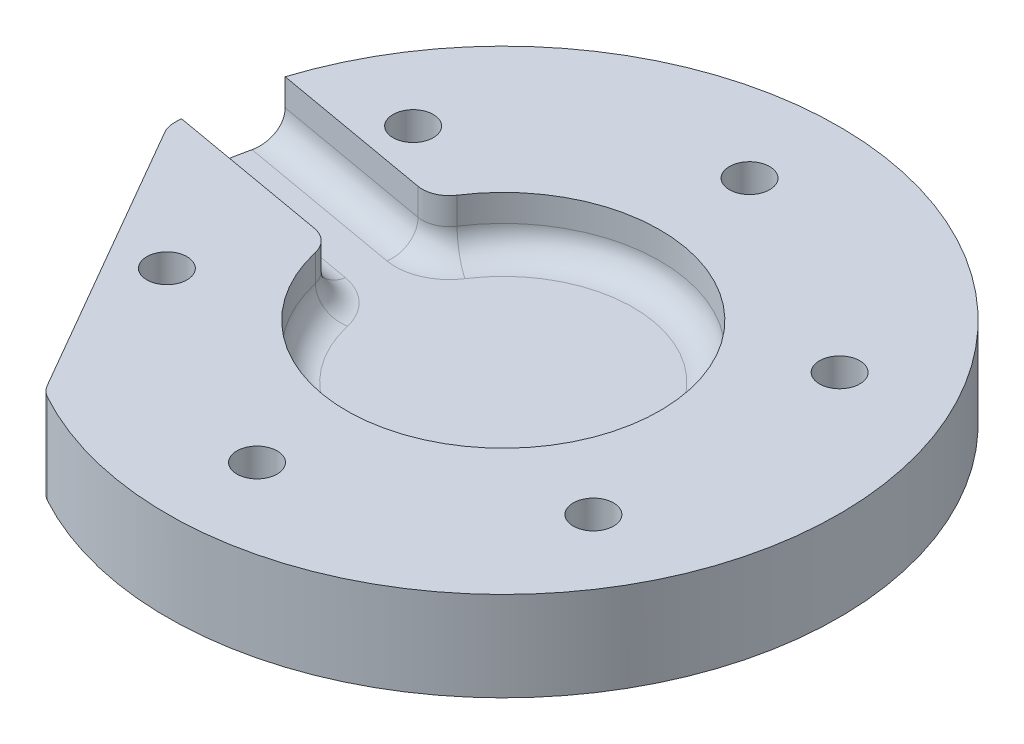
ISO-10303-21;
HEADER;
FILE_DESCRIPTION(('STEP AP214'),'2;1');
FILE_NAME('part.step','',(''),(''),'','','');
FILE_SCHEMA(('AUTOMOTIVE_DESIGN { 1 0 10303 214 1 1 1 1 }'));
ENDSEC;
DATA;
#1=APPLICATION_CONTEXT('core data for automotive mechanical design processes');
#2=APPLICATION_PROTOCOL_DEFINITION('international standard','automotive_design',2000,#1);
#3=PRODUCT_CONTEXT('',#1,'mechanical');
#4=PRODUCT('Part','Part','',(#3));
#5=PRODUCT_RELATED_PRODUCT_CATEGORY('part','',(#4));
#6=PRODUCT_DEFINITION_FORMATION('','',#4);
#7=PRODUCT_DEFINITION_CONTEXT('part definition',#1,'design');
#8=PRODUCT_DEFINITION('design','',#6,#7);
#9=PRODUCT_DEFINITION_SHAPE('','',#8);
#10=(LENGTH_UNIT() NAMED_UNIT(*) SI_UNIT(.MILLI.,.METRE.));
#11=(NAMED_UNIT(*) PLANE_ANGLE_UNIT() SI_UNIT($,.RADIAN.));
#12=(NAMED_UNIT(*) SI_UNIT($,.STERADIAN.) SOLID_ANGLE_UNIT());
#13=UNCERTAINTY_MEASURE_WITH_UNIT(LENGTH_MEASURE(1.E-05),#10,'distance_accuracy_value','');
#14=(GEOMETRIC_REPRESENTATION_CONTEXT(3) GLOBAL_UNCERTAINTY_ASSIGNED_CONTEXT((#13)) GLOBAL_UNIT_ASSIGNED_CONTEXT((#10,
#11,#12)) REPRESENTATION_CONTEXT('',''));
#15=CARTESIAN_POINT('',(0.,0.,0.));
#16=DIRECTION('',(0.,0.,1.));
#17=DIRECTION('',(1.,0.,0.));
#18=AXIS2_PLACEMENT_3D('',#15,#16,#17);
#19=CARTESIAN_POINT('',(0.,10.,0.));
#20=DIRECTION('',(0.,1.,0.));
#21=DIRECTION('',(0.,0.,1.));
#22=AXIS2_PLACEMENT_3D('',#19,#20,#21);
#23=PLANE('',#22);
#24=CARTESIAN_POINT('',(-23.8156986040703,10.,13.750000000001));
#25=DIRECTION('',(0.,1.,0.));
#26=DIRECTION('',(0.,0.,1.));
#27=AXIS2_PLACEMENT_3D('',#24,#25,#26);
#28=CIRCLE('',#27,2.25);
#29=CARTESIAN_POINT('',(-23.8156986040703,10.,16.000000000001));
#30=VERTEX_POINT('',#29);
#31=EDGE_CURVE('E174',#30,#30,#28,.T.);
#32=ORIENTED_EDGE('',*,*,#31,.F.);
#33=EDGE_LOOP('',(#32));
#34=FACE_BOUND('',#33,.T.);
#35=CARTESIAN_POINT('',(23.8156986040738,10.,13.749999999999));
#36=DIRECTION('',(0.,1.,0.));
#37=DIRECTION('',(0.,0.,1.));
#38=AXIS2_PLACEMENT_3D('',#35,#36,#37);
#39=CIRCLE('',#38,2.25);
#40=CARTESIAN_POINT('',(23.8156986040738,10.,15.999999999999));
#41=VERTEX_POINT('',#40);
#42=EDGE_CURVE('E186',#41,#41,#39,.T.);
#43=ORIENTED_EDGE('',*,*,#42,.F.);
#44=EDGE_LOOP('',(#43));
#45=FACE_BOUND('',#44,.T.);
#46=CARTESIAN_POINT('',(0.,10.,-27.5));
#47=DIRECTION('',(0.,1.,0.));
#48=DIRECTION('',(0.,0.,1.));
#49=AXIS2_PLACEMENT_3D('',#46,#47,#48);
#50=CIRCLE('',#49,2.25);
#51=CARTESIAN_POINT('',(0.,10.,-25.25));
#52=VERTEX_POINT('',#51);
#53=EDGE_CURVE('E198',#52,#52,#50,.T.);
#54=ORIENTED_EDGE('',*,*,#53,.F.);
#55=EDGE_LOOP('',(#54));
#56=FACE_BOUND('',#55,.T.);
#57=CARTESIAN_POINT('',(23.8156986040726,10.,-13.750000000001));
#58=DIRECTION('',(0.,1.,0.));
#59=DIRECTION('',(0.,0.,1.));
#60=AXIS2_PLACEMENT_3D('',#57,#58,#59);
#61=CIRCLE('',#60,2.25);
#62=CARTESIAN_POINT('',(23.8156986040726,10.,-11.500000000001));
#63=VERTEX_POINT('',#62);
#64=EDGE_CURVE('E192',#63,#63,#61,.T.);
#65=ORIENTED_EDGE('',*,*,#64,.F.);
#66=EDGE_LOOP('',(#65));
#67=FACE_BOUND('',#66,.T.);
#68=CARTESIAN_POINT('',(2.33805547061302E-12,10.,27.5));
#69=DIRECTION('',(0.,1.,0.));
#70=DIRECTION('',(0.,0.,1.));
#71=AXIS2_PLACEMENT_3D('',#68,#69,#70);
#72=CIRCLE('',#71,2.25);
#73=CARTESIAN_POINT('',(2.33805547061302E-12,10.,29.75));
#74=VERTEX_POINT('',#73);
#75=EDGE_CURVE('E180',#74,#74,#72,.T.);
#76=ORIENTED_EDGE('',*,*,#75,.F.);
#77=EDGE_LOOP('',(#76));
#78=FACE_BOUND('',#77,.T.);
#79=CARTESIAN_POINT('',(-23.8156986040715,10.,-13.749999999999));
#80=DIRECTION('',(0.,1.,0.));
#81=DIRECTION('',(0.,0.,1.));
#82=AXIS2_PLACEMENT_3D('',#79,#80,#81);
#83=CIRCLE('',#82,2.25);
#84=CARTESIAN_POINT('',(-23.8156986040715,10.,-11.499999999999));
#85=VERTEX_POINT('',#84);
#86=EDGE_CURVE('E168',#85,#85,#83,.T.);
#87=ORIENTED_EDGE('',*,*,#86,.F.);
#88=EDGE_LOOP('',(#87));
#89=FACE_BOUND('',#88,.T.);
#90=DIRECTION('',(-0.5,0.,-0.866025403784439));
#91=VECTOR('',#90,1.);
#92=CARTESIAN_POINT('',(-28.1249999999994,10.,16.2379763209579));
#93=LINE('',#92,#91);
#94=CARTESIAN_POINT('',(-19.1609298327772,10.,31.7642012931993));
#95=VERTEX_POINT('',#94);
#96=CARTESIAN_POINT('',(-37.0890701672217,10.,0.711751348716493));
#97=VERTEX_POINT('',#96);
#98=EDGE_CURVE('E139',#95,#97,#93,.T.);
#99=ORIENTED_EDGE('',*,*,#98,.F.);
#100=CARTESIAN_POINT('',(-16.5628536214239,10.,30.2642012931993));
#101=DIRECTION('',(0.,1.,0.));
#102=DIRECTION('',(0.,0.,1.));
#103=AXIS2_PLACEMENT_3D('',#100,#101,#102);
#104=CIRCLE('',#103,3.);
#105=CARTESIAN_POINT('',(-18.0031017624172,10.,32.8958709708688));
#106=VERTEX_POINT('',#105);
#107=EDGE_CURVE('E145',#95,#106,#104,.T.);
#108=ORIENTED_EDGE('',*,*,#107,.T.);
#109=CARTESIAN_POINT('',(0.,10.,0.));
#110=DIRECTION('',(0.,1.,0.));
#111=DIRECTION('',(0.,0.,1.));
#112=AXIS2_PLACEMENT_3D('',#109,#110,#111);
#113=CIRCLE('',#112,37.5);
#114=CARTESIAN_POINT('',(-35.7323085095947,10.,-11.3777031326691));
#115=VERTEX_POINT('',#114);
#116=EDGE_CURVE('E142',#106,#115,#113,.T.);
#117=ORIENTED_EDGE('',*,*,#116,.T.);
#118=DIRECTION('',(-0.984807753012208,0.,-0.173648177666934));
#119=VECTOR('',#118,1.);
#120=CARTESIAN_POINT('',(0.868240888334671,10.,-4.92403876506104));
#121=LINE('',#120,#119);
#122=CARTESIAN_POINT('',(-17.7195978261983,10.,-8.20157624349062));
#123=VERTEX_POINT('',#122);
#124=EDGE_CURVE('E128',#123,#115,#121,.T.);
#125=ORIENTED_EDGE('',*,*,#124,.F.);
#126=CARTESIAN_POINT('',(-17.1986532931975,10.,-11.1559995025272));
#127=DIRECTION('',(0.,1.,0.));
#128=DIRECTION('',(0.,0.,1.));
#129=AXIS2_PLACEMENT_3D('',#126,#127,#128);
#130=CIRCLE('',#129,3.);
#131=CARTESIAN_POINT('',(-14.68177720151,10.,-9.52341420947448));
#132=VERTEX_POINT('',#131);
#133=EDGE_CURVE('E219',#123,#132,#130,.T.);
#134=ORIENTED_EDGE('',*,*,#133,.T.);
#135=CARTESIAN_POINT('',(0.,10.,0.));
#136=DIRECTION('',(0.,1.,0.));
#137=DIRECTION('',(0.,0.,1.));
#138=AXIS2_PLACEMENT_3D('',#135,#136,#137);
#139=CIRCLE('',#138,17.5);
#140=CARTESIAN_POINT('',(-17.053557189156,10.,3.9276185145947));
#141=VERTEX_POINT('',#140);
#142=EDGE_CURVE('E159',#141,#132,#139,.T.);
#143=ORIENTED_EDGE('',*,*,#142,.F.);
#144=CARTESIAN_POINT('',(-19.9770241358684,10.,4.60092454566808));
#145=DIRECTION('',(0.,1.,0.));
#146=DIRECTION('',(0.,0.,1.));
#147=AXIS2_PLACEMENT_3D('',#144,#145,#146);
#148=CIRCLE('',#147,3.);
#149=CARTESIAN_POINT('',(-19.4560796028676,10.,1.64650128663146));
#150=VERTEX_POINT('',#149);
#151=EDGE_CURVE('E221',#141,#150,#148,.T.);
#152=ORIENTED_EDGE('',*,*,#151,.T.);
#153=DIRECTION('',(-0.984807753012208,0.,-0.173648177666934));
#154=VECTOR('',#153,1.);
#155=CARTESIAN_POINT('',(-0.868240888334671,10.,4.92403876506104));
#156=LINE('',#155,#154);
#157=CARTESIAN_POINT('',(-37.468790286264,10.,-1.52962560254701));
#158=VERTEX_POINT('',#157);
#159=EDGE_CURVE('E138',#150,#158,#156,.T.);
#160=ORIENTED_EDGE('',*,*,#159,.T.);
#161=CARTESIAN_POINT('',(-37.4902108215961,10.,-0.856792012264681));
#162=VERTEX_POINT('',#161);
#163=EDGE_CURVE('E149',#158,#162,#113,.T.);
#164=ORIENTED_EDGE('',*,*,#163,.T.);
#165=CARTESIAN_POINT('',(-34.4909939558684,10.,-0.788248651283506));
#166=DIRECTION('',(0.,1.,0.));
#167=DIRECTION('',(0.,0.,1.));
#168=AXIS2_PLACEMENT_3D('',#165,#166,#167);
#169=CIRCLE('',#168,3.);
#170=EDGE_CURVE('E223',#162,#97,#169,.T.);
#171=ORIENTED_EDGE('',*,*,#170,.T.);
#172=EDGE_LOOP('',(#99,#108,#117,#125,#134,#143,#152,#160,#164,#171));
#173=FACE_BOUND('',#172,.T.);
#174=ADVANCED_FACE('F33',(#34,#45,#56,#67,#78,#89,#173),#23,.T.);
#175=CARTESIAN_POINT('',(0.,10.,0.));
#176=DIRECTION('',(0.,-1.,0.));
#177=DIRECTION('',(0.,0.,-1.));
#178=AXIS2_PLACEMENT_3D('',#175,#176,#177);
#179=CYLINDRICAL_SURFACE('',#178,37.5);
#180=ORIENTED_EDGE('',*,*,#116,.F.);
#181=DIRECTION('',(0.,-1.,0.));
#182=VECTOR('',#181,1.);
#183=CARTESIAN_POINT('',(-18.0031017624172,10.,32.8958709708688));
#184=LINE('',#183,#182);
#185=CARTESIAN_POINT('',(-18.0031017624172,0.,32.8958709708688));
#186=VERTEX_POINT('',#185);
#187=EDGE_CURVE('E208',#106,#186,#184,.T.);
#188=ORIENTED_EDGE('',*,*,#187,.T.);
#189=CARTESIAN_POINT('',(0.,0.,0.));
#190=DIRECTION('',(0.,1.,0.));
#191=DIRECTION('',(0.,0.,1.));
#192=AXIS2_PLACEMENT_3D('',#189,#190,#191);
#193=CIRCLE('',#192,37.5);
#194=CARTESIAN_POINT('',(-37.4902108215961,0.,-0.856792012264681));
#195=VERTEX_POINT('',#194);
#196=EDGE_CURVE('E150',#186,#195,#193,.T.);
#197=ORIENTED_EDGE('',*,*,#196,.T.);
#198=DIRECTION('',(0.,-1.,0.));
#199=VECTOR('',#198,1.);
#200=CARTESIAN_POINT('',(-37.4902108215961,10.,-0.856792012264681));
#201=LINE('',#200,#199);
#202=EDGE_CURVE('E204',#195,#162,#201,.F.);
#203=ORIENTED_EDGE('',*,*,#202,.T.);
#204=ORIENTED_EDGE('',*,*,#163,.F.);
#205=DIRECTION('',(0.,1.,0.));
#206=VECTOR('',#205,1.);
#207=CARTESIAN_POINT('',(-37.468790286264,4.,-1.52962560254701));
#208=LINE('',#207,#206);
#209=CARTESIAN_POINT('',(-37.468790286264,7.,-1.52962560254701));
#210=VERTEX_POINT('',#209);
#211=EDGE_CURVE('E155',#210,#158,#208,.T.);
#212=ORIENTED_EDGE('',*,*,#211,.F.);
#213=CARTESIAN_POINT('',(-37.468790286264,7.,-1.52962560254701));
#214=CARTESIAN_POINT('',(-37.4687885385674,6.91607473093555,-1.52961665398384));
#215=CARTESIAN_POINT('',(-37.4686452889399,6.83215369455785,-1.53317602931308));
#216=CARTESIAN_POINT('',(-37.468063227685,6.66491826832527,-1.54736234990552));
#217=CARTESIAN_POINT('',(-37.4676244382832,6.58160383332813,-1.55798876370281));
#218=CARTESIAN_POINT('',(-37.4664393852418,6.41625662107854,-1.5862247968106));
#219=CARTESIAN_POINT('',(-37.4656934552811,6.33422255290289,-1.60382683698727));
#220=CARTESIAN_POINT('',(-37.4638703778373,6.17195103866243,-1.64585988350524));
#221=CARTESIAN_POINT('',(-37.4627932325401,6.09171358074312,-1.67029084477316));
#222=CARTESIAN_POINT('',(-37.4590179293151,5.85448826748709,-1.75360078025125));
#223=CARTESIAN_POINT('',(-37.4557753329092,5.70089770069336,-1.82251224893352));
#224=CARTESIAN_POINT('',(-37.4475192496891,5.40749281606239,-1.98490953996724));
#225=CARTESIAN_POINT('',(-37.4425058795835,5.26767759109256,-2.07839374266814));
#226=CARTESIAN_POINT('',(-37.4302981101241,5.00487012995653,-2.2877513212175));
#227=CARTESIAN_POINT('',(-37.4230927793752,4.88196680121549,-2.40373583178031));
#228=CARTESIAN_POINT('',(-37.406144534804,4.6572171945591,-2.654449907205));
#229=CARTESIAN_POINT('',(-37.3964010702185,4.55537549553449,-2.78918353757931));
#230=CARTESIAN_POINT('',(-37.3740313302424,4.3749911604644,-3.07447055090138));
#231=CARTESIAN_POINT('',(-37.3613863986207,4.29660721864267,-3.22512275102231));
#232=CARTESIAN_POINT('',(-37.3331343057481,4.16631519135388,-3.53716805156448));
#233=CARTESIAN_POINT('',(-37.3175289133604,4.11439136402112,-3.69855470099355));
#234=CARTESIAN_POINT('',(-37.2891191848984,4.05106027067528,-3.97288763283056));
#235=CARTESIAN_POINT('',(-37.2770964616604,4.03193164985782,-4.08419359322241));
#236=CARTESIAN_POINT('',(-37.2519008419326,4.0064015837983,-4.30797898586863));
#237=CARTESIAN_POINT('',(-37.2387294483442,3.9999837612315,-4.42045672014535));
#238=CARTESIAN_POINT('',(-37.2250266101708,4.,-4.53292332519234));
#239=B_SPLINE_CURVE_WITH_KNOTS('',3,(#213,#214,#215,#216,#217,#218,#219,#220,#221,#222,#223,
#224,#225,#226,#227,#228,#229,#230,#231,#232,#233,#234,#235,#236,#237,#238),.UNSPECIFIED.,.F.,
.F.,(4,2,2,2,2,2,2,2,2,2,2,2,4),(0.,0.251692700658805,0.503366475289664,0.754767548613932,
1.00616696263818,1.50869595507598,2.01119183286945,2.51623594149171,3.02138973376223,
3.52988746532684,4.03808232308492,4.378130837416,4.71774092787654),.UNSPECIFIED.);
#240=CARTESIAN_POINT('',(-37.2250266101708,4.,-4.53292332519234));
#241=VERTEX_POINT('',#240);
#242=EDGE_CURVE('E11',#210,#241,#239,.T.);
#243=ORIENTED_EDGE('',*,*,#242,.T.);
#244=CARTESIAN_POINT('',(0.,4.,0.));
#245=DIRECTION('',(0.,1.,0.));
#246=DIRECTION('',(0.,0.,1.));
#247=AXIS2_PLACEMENT_3D('',#244,#245,#246);
#248=CIRCLE('',#247,37.5);
#249=CARTESIAN_POINT('',(-36.5304338995031,4.,-8.47215433724118));
#250=VERTEX_POINT('',#249);
#251=EDGE_CURVE('E156',#250,#241,#248,.T.);
#252=ORIENTED_EDGE('',*,*,#251,.F.);
#253=CARTESIAN_POINT('',(-36.5304338995031,4.,-8.47215433724118));
#254=CARTESIAN_POINT('',(-36.5113061766243,3.99999185556205,-8.55464202668558));
#255=CARTESIAN_POINT('',(-36.4918947558201,4.00357480316312,-8.63705911337248));
#256=CARTESIAN_POINT('',(-36.4526606320191,4.01785162064364,-8.80117013385181));
#257=CARTESIAN_POINT('',(-36.4328379598345,4.0285449596416,-8.88286412117144));
#258=CARTESIAN_POINT('',(-36.3929526662557,4.0569584087229,-9.04488587081703));
#259=CARTESIAN_POINT('',(-36.3728902791517,4.07467212781287,-9.12521480664457));
#260=CARTESIAN_POINT('',(-36.3326869522386,4.11697580130757,-9.28399591653277));
#261=CARTESIAN_POINT('',(-36.3125460128146,4.14156572205405,-9.36244809977789));
#262=CARTESIAN_POINT('',(-36.25225729475,4.22543430714798,-9.59422817162467));
#263=CARTESIAN_POINT('',(-36.212222077861,4.29482717691522,-9.74406672595418));
#264=CARTESIAN_POINT('',(-36.1341008059691,4.45850047242244,-10.0298950754094));
#265=CARTESIAN_POINT('',(-36.096014557923,4.55277842760379,-10.1658862434292));
#266=CARTESIAN_POINT('',(-36.0232459930632,4.76392513867184,-10.4208147497941));
#267=CARTESIAN_POINT('',(-35.9885738523071,4.88085851983349,-10.5397015653744));
#268=CARTESIAN_POINT('',(-35.9243208215486,5.1338991363961,-10.7566732352616));
#269=CARTESIAN_POINT('',(-35.8947408385076,5.27000977961426,-10.8547543846039));
#270=CARTESIAN_POINT('',(-35.8421275555655,5.5573559432218,-11.0272407929011));
#271=CARTESIAN_POINT('',(-35.8190852992912,5.70857038413879,-11.1016784591763));
#272=CARTESIAN_POINT('',(-35.7806578658865,6.02197020400217,-11.2249150704758));
#273=CARTESIAN_POINT('',(-35.7652674953278,6.18414805679171,-11.2737314062651));
#274=CARTESIAN_POINT('',(-35.746880684548,6.45615411997131,-11.3318616950539));
#275=CARTESIAN_POINT('',(-35.7414258024141,6.56420517061319,-11.3490408699051));
#276=CARTESIAN_POINT('',(-35.7341371978182,6.78148800360131,-11.3719602980172));
#277=CARTESIAN_POINT('',(-35.7322986576543,6.89071801987915,-11.3777157700632));
#278=CARTESIAN_POINT('',(-35.7323085095947,7.,-11.3777031326691));
#279=B_SPLINE_CURVE_WITH_KNOTS('',3,(#253,#254,#255,#256,#257,#258,#259,#260,#261,#262,#263,
#264,#265,#266,#267,#268,#269,#270,#271,#272,#273,#274,#275,#276,#277,#278),.UNSPECIFIED.,.F.,
.F.,(4,2,2,2,2,2,2,2,2,2,2,2,4),(0.,0.253944686852565,0.50787041562048,0.761565512474324,
1.01525936754024,1.52237729016386,2.0294448857095,2.5379807881834,3.04660717219958,
3.55453336036125,4.06211434061416,4.39012991539726,4.71770821006358),.UNSPECIFIED.);
#280=CARTESIAN_POINT('',(-35.7323085095947,7.,-11.3777031326691));
#281=VERTEX_POINT('',#280);
#282=EDGE_CURVE('E43',#250,#281,#279,.T.);
#283=ORIENTED_EDGE('',*,*,#282,.T.);
#284=DIRECTION('',(0.,1.,0.));
#285=VECTOR('',#284,1.);
#286=CARTESIAN_POINT('',(-35.7323085095947,4.,-11.3777031326691));
#287=LINE('',#286,#285);
#288=EDGE_CURVE('E132',#281,#115,#287,.T.);
#289=ORIENTED_EDGE('',*,*,#288,.T.);
#290=EDGE_LOOP('',(#180,#188,#197,#203,#204,#212,#243,#252,#283,#289));
#291=FACE_BOUND('',#290,.T.);
#292=ADVANCED_FACE('F152',(#291),#179,.T.);
#293=CARTESIAN_POINT('',(0.,0.,0.));
#294=DIRECTION('',(0.,1.,0.));
#295=DIRECTION('',(0.,0.,1.));
#296=AXIS2_PLACEMENT_3D('',#293,#294,#295);
#297=PLANE('',#296);
#298=CARTESIAN_POINT('',(-23.8156986040715,0.,-13.749999999999));
#299=DIRECTION('',(0.,1.,0.));
#300=DIRECTION('',(0.,0.,1.));
#301=AXIS2_PLACEMENT_3D('',#298,#299,#300);
#302=CIRCLE('',#301,2.25);
#303=CARTESIAN_POINT('',(-23.8156986040715,0.,-11.499999999999));
#304=VERTEX_POINT('',#303);
#305=EDGE_CURVE('E167',#304,#304,#302,.T.);
#306=ORIENTED_EDGE('',*,*,#305,.T.);
#307=EDGE_LOOP('',(#306));
#308=FACE_BOUND('',#307,.T.);
#309=CARTESIAN_POINT('',(2.33805547061302E-12,0.,27.5));
#310=DIRECTION('',(0.,1.,0.));
#311=DIRECTION('',(0.,0.,1.));
#312=AXIS2_PLACEMENT_3D('',#309,#310,#311);
#313=CIRCLE('',#312,2.25);
#314=CARTESIAN_POINT('',(2.33805547061302E-12,0.,29.75));
#315=VERTEX_POINT('',#314);
#316=EDGE_CURVE('E177',#315,#315,#313,.T.);
#317=ORIENTED_EDGE('',*,*,#316,.T.);
#318=EDGE_LOOP('',(#317));
#319=FACE_BOUND('',#318,.T.);
#320=CARTESIAN_POINT('',(23.8156986040726,0.,-13.750000000001));
#321=DIRECTION('',(0.,1.,0.));
#322=DIRECTION('',(0.,0.,1.));
#323=AXIS2_PLACEMENT_3D('',#320,#321,#322);
#324=CIRCLE('',#323,2.25);
#325=CARTESIAN_POINT('',(23.8156986040726,0.,-11.500000000001));
#326=VERTEX_POINT('',#325);
#327=EDGE_CURVE('E189',#326,#326,#324,.T.);
#328=ORIENTED_EDGE('',*,*,#327,.T.);
#329=EDGE_LOOP('',(#328));
#330=FACE_BOUND('',#329,.T.);
#331=CARTESIAN_POINT('',(0.,0.,-27.5));
#332=DIRECTION('',(0.,1.,0.));
#333=DIRECTION('',(0.,0.,1.));
#334=AXIS2_PLACEMENT_3D('',#331,#332,#333);
#335=CIRCLE('',#334,2.25);
#336=CARTESIAN_POINT('',(0.,0.,-25.25));
#337=VERTEX_POINT('',#336);
#338=EDGE_CURVE('E195',#337,#337,#335,.T.);
#339=ORIENTED_EDGE('',*,*,#338,.T.);
#340=EDGE_LOOP('',(#339));
#341=FACE_BOUND('',#340,.T.);
#342=CARTESIAN_POINT('',(23.8156986040738,0.,13.749999999999));
#343=DIRECTION('',(0.,1.,0.));
#344=DIRECTION('',(0.,0.,1.));
#345=AXIS2_PLACEMENT_3D('',#342,#343,#344);
#346=CIRCLE('',#345,2.25);
#347=CARTESIAN_POINT('',(23.8156986040738,0.,15.999999999999));
#348=VERTEX_POINT('',#347);
#349=EDGE_CURVE('E183',#348,#348,#346,.T.);
#350=ORIENTED_EDGE('',*,*,#349,.T.);
#351=EDGE_LOOP('',(#350));
#352=FACE_BOUND('',#351,.T.);
#353=CARTESIAN_POINT('',(-23.8156986040703,0.,13.750000000001));
#354=DIRECTION('',(0.,1.,0.));
#355=DIRECTION('',(0.,0.,1.));
#356=AXIS2_PLACEMENT_3D('',#353,#354,#355);
#357=CIRCLE('',#356,2.25);
#358=CARTESIAN_POINT('',(-23.8156986040703,0.,16.000000000001));
#359=VERTEX_POINT('',#358);
#360=EDGE_CURVE('E171',#359,#359,#357,.T.);
#361=ORIENTED_EDGE('',*,*,#360,.T.);
#362=EDGE_LOOP('',(#361));
#363=FACE_BOUND('',#362,.T.);
#364=ORIENTED_EDGE('',*,*,#196,.F.);
#365=CARTESIAN_POINT('',(-16.5628536214239,0.,30.2642012931993));
#366=DIRECTION('',(0.,1.,0.));
#367=DIRECTION('',(0.,0.,1.));
#368=AXIS2_PLACEMENT_3D('',#365,#366,#367);
#369=CIRCLE('',#368,3.);
#370=CARTESIAN_POINT('',(-19.1609298327772,0.,31.7642012931993));
#371=VERTEX_POINT('',#370);
#372=EDGE_CURVE('E212',#186,#371,#369,.F.);
#373=ORIENTED_EDGE('',*,*,#372,.T.);
#374=DIRECTION('',(-0.5,0.,-0.866025403784439));
#375=VECTOR('',#374,1.);
#376=CARTESIAN_POINT('',(-28.1249999999994,0.,16.2379763209579));
#377=LINE('',#376,#375);
#378=CARTESIAN_POINT('',(-37.0890701672217,0.,0.711751348716493));
#379=VERTEX_POINT('',#378);
#380=EDGE_CURVE('E352',#371,#379,#377,.T.);
#381=ORIENTED_EDGE('',*,*,#380,.T.);
#382=CARTESIAN_POINT('',(-34.4909939558684,0.,-0.788248651283506));
#383=DIRECTION('',(0.,1.,0.));
#384=DIRECTION('',(0.,0.,1.));
#385=AXIS2_PLACEMENT_3D('',#382,#383,#384);
#386=CIRCLE('',#385,3.);
#387=EDGE_CURVE('E210',#379,#195,#386,.F.);
#388=ORIENTED_EDGE('',*,*,#387,.T.);
#389=EDGE_LOOP('',(#364,#373,#381,#388));
#390=FACE_BOUND('',#389,.T.);
#391=ADVANCED_FACE('F264',(#308,#319,#330,#341,#352,#363,#390),#297,.F.);
#392=CARTESIAN_POINT('',(0.,4.,0.));
#393=DIRECTION('',(0.,1.,0.));
#394=DIRECTION('',(0.,0.,1.));
#395=AXIS2_PLACEMENT_3D('',#392,#393,#394);
#396=CYLINDRICAL_SURFACE('',#395,17.5);
#397=CARTESIAN_POINT('',(0.,7.,0.));
#398=DIRECTION('',(0.,1.,0.));
#399=DIRECTION('',(0.,0.,1.));
#400=AXIS2_PLACEMENT_3D('',#397,#398,#399);
#401=CIRCLE('',#400,17.5);
#402=CARTESIAN_POINT('',(-14.68177720151,7.,-9.52341420947448));
#403=VERTEX_POINT('',#402);
#404=CARTESIAN_POINT('',(-17.053557189156,7.,3.9276185145947));
#405=VERTEX_POINT('',#404);
#406=EDGE_CURVE('E231',#403,#405,#401,.F.);
#407=ORIENTED_EDGE('',*,*,#406,.T.);
#408=DIRECTION('',(0.,1.,0.));
#409=VECTOR('',#408,1.);
#410=CARTESIAN_POINT('',(-17.053557189156,4.,3.9276185145947));
#411=LINE('',#410,#409);
#412=EDGE_CURVE('E235',#405,#141,#411,.T.);
#413=ORIENTED_EDGE('',*,*,#412,.T.);
#414=ORIENTED_EDGE('',*,*,#142,.T.);
#415=DIRECTION('',(0.,1.,0.));
#416=VECTOR('',#415,1.);
#417=CARTESIAN_POINT('',(-14.68177720151,4.,-9.52341420947448));
#418=LINE('',#417,#416);
#419=EDGE_CURVE('E233',#132,#403,#418,.F.);
#420=ORIENTED_EDGE('',*,*,#419,.T.);
#421=EDGE_LOOP('',(#407,#413,#414,#420));
#422=FACE_BOUND('',#421,.T.);
#423=ADVANCED_FACE('F313',(#422),#396,.F.);
#424=CARTESIAN_POINT('',(0.,10.,-27.5));
#425=DIRECTION('',(0.,-1.,0.));
#426=DIRECTION('',(0.,0.,-1.));
#427=AXIS2_PLACEMENT_3D('',#424,#425,#426);
#428=CYLINDRICAL_SURFACE('',#427,2.25);
#429=ORIENTED_EDGE('',*,*,#53,.T.);
#430=EDGE_LOOP('',(#429));
#431=FACE_BOUND('',#430,.T.);
#432=ORIENTED_EDGE('',*,*,#338,.F.);
#433=EDGE_LOOP('',(#432));
#434=FACE_BOUND('',#433,.T.);
#435=ADVANCED_FACE('F309',(#431,#434),#428,.F.);
#436=CARTESIAN_POINT('',(23.8156986040726,10.,-13.750000000001));
#437=DIRECTION('',(0.,-1.,0.));
#438=DIRECTION('',(0.,0.,-1.));
#439=AXIS2_PLACEMENT_3D('',#436,#437,#438);
#440=CYLINDRICAL_SURFACE('',#439,2.25);
#441=ORIENTED_EDGE('',*,*,#64,.T.);
#442=EDGE_LOOP('',(#441));
#443=FACE_BOUND('',#442,.T.);
#444=ORIENTED_EDGE('',*,*,#327,.F.);
#445=EDGE_LOOP('',(#444));
#446=FACE_BOUND('',#445,.T.);
#447=ADVANCED_FACE('F312',(#443,#446),#440,.F.);
#448=CARTESIAN_POINT('',(23.8156986040738,10.,13.749999999999));
#449=DIRECTION('',(0.,-1.,0.));
#450=DIRECTION('',(0.,0.,-1.));
#451=AXIS2_PLACEMENT_3D('',#448,#449,#450);
#452=CYLINDRICAL_SURFACE('',#451,2.25);
#453=ORIENTED_EDGE('',*,*,#42,.T.);
#454=EDGE_LOOP('',(#453));
#455=FACE_BOUND('',#454,.T.);
#456=ORIENTED_EDGE('',*,*,#349,.F.);
#457=EDGE_LOOP('',(#456));
#458=FACE_BOUND('',#457,.T.);
#459=ADVANCED_FACE('F317',(#455,#458),#452,.F.);
#460=CARTESIAN_POINT('',(2.33805547061302E-12,10.,27.5));
#461=DIRECTION('',(0.,-1.,0.));
#462=DIRECTION('',(0.,0.,-1.));
#463=AXIS2_PLACEMENT_3D('',#460,#461,#462);
#464=CYLINDRICAL_SURFACE('',#463,2.25);
#465=ORIENTED_EDGE('',*,*,#75,.T.);
#466=EDGE_LOOP('',(#465));
#467=FACE_BOUND('',#466,.T.);
#468=ORIENTED_EDGE('',*,*,#316,.F.);
#469=EDGE_LOOP('',(#468));
#470=FACE_BOUND('',#469,.T.);
#471=ADVANCED_FACE('F321',(#467,#470),#464,.F.);
#472=CARTESIAN_POINT('',(-23.8156986040703,10.,13.750000000001));
#473=DIRECTION('',(0.,-1.,0.));
#474=DIRECTION('',(0.,0.,-1.));
#475=AXIS2_PLACEMENT_3D('',#472,#473,#474);
#476=CYLINDRICAL_SURFACE('',#475,2.25);
#477=ORIENTED_EDGE('',*,*,#31,.T.);
#478=EDGE_LOOP('',(#477));
#479=FACE_BOUND('',#478,.T.);
#480=ORIENTED_EDGE('',*,*,#360,.F.);
#481=EDGE_LOOP('',(#480));
#482=FACE_BOUND('',#481,.T.);
#483=ADVANCED_FACE('F325',(#479,#482),#476,.F.);
#484=CARTESIAN_POINT('',(-23.8156986040715,10.,-13.749999999999));
#485=DIRECTION('',(0.,-1.,0.));
#486=DIRECTION('',(0.,0.,-1.));
#487=AXIS2_PLACEMENT_3D('',#484,#485,#486);
#488=CYLINDRICAL_SURFACE('',#487,2.25);
#489=ORIENTED_EDGE('',*,*,#86,.T.);
#490=EDGE_LOOP('',(#489));
#491=FACE_BOUND('',#490,.T.);
#492=ORIENTED_EDGE('',*,*,#305,.F.);
#493=EDGE_LOOP('',(#492));
#494=FACE_BOUND('',#493,.T.);
#495=ADVANCED_FACE('F329',(#491,#494),#488,.F.);
#496=CARTESIAN_POINT('',(0.,4.,0.));
#497=DIRECTION('',(0.,1.,0.));
#498=DIRECTION('',(0.,0.,1.));
#499=AXIS2_PLACEMENT_3D('',#496,#497,#498);
#500=PLANE('',#499);
#501=CARTESIAN_POINT('',(-17.1986532931975,4.,-11.1559995025272));
#502=DIRECTION('',(0.,1.,0.));
#503=DIRECTION('',(0.,0.,1.));
#504=AXIS2_PLACEMENT_3D('',#501,#502,#503);
#505=CIRCLE('',#504,6.);
#506=CARTESIAN_POINT('',(-18.2405423591991,4.,-5.247152984454));
#507=VERTEX_POINT('',#506);
#508=CARTESIAN_POINT('',(-12.1649011098226,4.,-7.89082891642171));
#509=VERTEX_POINT('',#508);
#510=EDGE_CURVE('E51',#507,#509,#505,.T.);
#511=ORIENTED_EDGE('',*,*,#510,.F.);
#512=DIRECTION('',(-0.984807753012208,0.,-0.173648177666934));
#513=VECTOR('',#512,1.);
#514=CARTESIAN_POINT('',(0.347296355333868,4.,-1.96961550602441));
#515=LINE('',#514,#513);
#516=EDGE_CURVE('E247',#507,#250,#515,.T.);
#517=ORIENTED_EDGE('',*,*,#516,.T.);
#518=ORIENTED_EDGE('',*,*,#251,.T.);
#519=DIRECTION('',(-0.984807753012208,0.,-0.173648177666934));
#520=VECTOR('',#519,1.);
#521=CARTESIAN_POINT('',(-16.8630244591148,4.,-0.942552964717277));
#522=LINE('',#521,#520);
#523=CARTESIAN_POINT('',(-18.9351350698668,4.,-1.30792197240516));
#524=VERTEX_POINT('',#523);
#525=EDGE_CURVE('E243',#241,#524,#522,.F.);
#526=ORIENTED_EDGE('',*,*,#525,.T.);
#527=CARTESIAN_POINT('',(-19.9770241358684,4.,4.60092454566808));
#528=DIRECTION('',(0.,1.,0.));
#529=DIRECTION('',(0.,0.,1.));
#530=AXIS2_PLACEMENT_3D('',#527,#528,#529);
#531=CIRCLE('',#530,6.);
#532=CARTESIAN_POINT('',(-14.1300902424435,4.,3.25431248352132));
#533=VERTEX_POINT('',#532);
#534=EDGE_CURVE('E240',#533,#524,#531,.T.);
#535=ORIENTED_EDGE('',*,*,#534,.F.);
#536=CARTESIAN_POINT('',(0.,4.,0.));
#537=DIRECTION('',(0.,1.,0.));
#538=DIRECTION('',(0.,0.,1.));
#539=AXIS2_PLACEMENT_3D('',#536,#537,#538);
#540=CIRCLE('',#539,14.5);
#541=EDGE_CURVE('E56',#533,#509,#540,.T.);
#542=ORIENTED_EDGE('',*,*,#541,.T.);
#543=EDGE_LOOP('',(#511,#517,#518,#526,#535,#542));
#544=FACE_BOUND('',#543,.T.);
#545=ADVANCED_FACE('F333',(#544),#500,.T.);
#546=CARTESIAN_POINT('',(-0.868240888334671,4.,4.92403876506104));
#547=DIRECTION('',(0.173648177666934,0.,-0.984807753012207));
#548=DIRECTION('',(-0.984807753012208,0.,-0.173648177666934));
#549=AXIS2_PLACEMENT_3D('',#546,#547,#548);
#550=PLANE('',#549);
#551=ORIENTED_EDGE('',*,*,#159,.F.);
#552=DIRECTION('',(0.,-1.,0.));
#553=VECTOR('',#552,1.);
#554=CARTESIAN_POINT('',(-19.4560796028676,4.,1.64650128663146));
#555=LINE('',#554,#553);
#556=CARTESIAN_POINT('',(-19.4560796028676,7.,1.64650128663146));
#557=VERTEX_POINT('',#556);
#558=EDGE_CURVE('E228',#150,#557,#555,.T.);
#559=ORIENTED_EDGE('',*,*,#558,.T.);
#560=DIRECTION('',(-0.984807753012208,0.,-0.173648177666934));
#561=VECTOR('',#560,1.);
#562=CARTESIAN_POINT('',(-37.468790286264,7.,-1.52962560254702));
#563=LINE('',#562,#561);
#564=EDGE_CURVE('E226',#557,#210,#563,.T.);
#565=ORIENTED_EDGE('',*,*,#564,.T.);
#566=ORIENTED_EDGE('',*,*,#211,.T.);
#567=EDGE_LOOP('',(#551,#559,#565,#566));
#568=FACE_BOUND('',#567,.T.);
#569=ADVANCED_FACE('F340',(#568),#550,.T.);
#570=CARTESIAN_POINT('',(0.868240888334671,4.,-4.92403876506104));
#571=DIRECTION('',(0.173648177666934,0.,-0.984807753012207));
#572=DIRECTION('',(-0.984807753012208,0.,-0.173648177666934));
#573=AXIS2_PLACEMENT_3D('',#570,#571,#572);
#574=PLANE('',#573);
#575=DIRECTION('',(-0.984807753012208,0.,-0.173648177666934));
#576=VECTOR('',#575,1.);
#577=CARTESIAN_POINT('',(0.868240888334671,7.,-4.92403876506104));
#578=LINE('',#577,#576);
#579=CARTESIAN_POINT('',(-17.7195978261983,7.,-8.20157624349062));
#580=VERTEX_POINT('',#579);
#581=EDGE_CURVE('E237',#281,#580,#578,.F.);
#582=ORIENTED_EDGE('',*,*,#581,.T.);
#583=DIRECTION('',(0.,1.,0.));
#584=VECTOR('',#583,1.);
#585=CARTESIAN_POINT('',(-17.7195978261983,4.,-8.20157624349062));
#586=LINE('',#585,#584);
#587=EDGE_CURVE('E135',#580,#123,#586,.T.);
#588=ORIENTED_EDGE('',*,*,#587,.T.);
#589=ORIENTED_EDGE('',*,*,#124,.T.);
#590=ORIENTED_EDGE('',*,*,#288,.F.);
#591=EDGE_LOOP('',(#582,#588,#589,#590));
#592=FACE_BOUND('',#591,.T.);
#593=ADVANCED_FACE('F130',(#592),#574,.F.);
#594=CARTESIAN_POINT('',(-28.1249999999994,10.,16.2379763209579));
#595=DIRECTION('',(-0.866025403784439,0.,0.5));
#596=DIRECTION('',(0.5,0.,0.866025403784439));
#597=AXIS2_PLACEMENT_3D('',#594,#595,#596);
#598=PLANE('',#597);
#599=ORIENTED_EDGE('',*,*,#380,.F.);
#600=DIRECTION('',(0.,1.,0.));
#601=VECTOR('',#600,1.);
#602=CARTESIAN_POINT('',(-19.1609298327772,10.,31.7642012931993));
#603=LINE('',#602,#601);
#604=EDGE_CURVE('E217',#371,#95,#603,.T.);
#605=ORIENTED_EDGE('',*,*,#604,.T.);
#606=ORIENTED_EDGE('',*,*,#98,.T.);
#607=DIRECTION('',(0.,1.,0.));
#608=VECTOR('',#607,1.);
#609=CARTESIAN_POINT('',(-37.0890701672217,0.,0.711751348716495));
#610=LINE('',#609,#608);
#611=EDGE_CURVE('E214',#97,#379,#610,.F.);
#612=ORIENTED_EDGE('',*,*,#611,.T.);
#613=EDGE_LOOP('',(#599,#605,#606,#612));
#614=FACE_BOUND('',#613,.T.);
#615=ADVANCED_FACE('F271',(#614),#598,.T.);
#616=CARTESIAN_POINT('',(-16.5628536214239,10.,30.2642012931993));
#617=DIRECTION('',(0.,-1.,0.));
#618=DIRECTION('',(0.,0.,-1.));
#619=AXIS2_PLACEMENT_3D('',#616,#617,#618);
#620=CYLINDRICAL_SURFACE('',#619,3.);
#621=ORIENTED_EDGE('',*,*,#107,.F.);
#622=ORIENTED_EDGE('',*,*,#604,.F.);
#623=ORIENTED_EDGE('',*,*,#372,.F.);
#624=ORIENTED_EDGE('',*,*,#187,.F.);
#625=EDGE_LOOP('',(#621,#622,#623,#624));
#626=FACE_BOUND('',#625,.T.);
#627=ADVANCED_FACE('F266',(#626),#620,.T.);
#628=CARTESIAN_POINT('',(-34.4909939558684,10.,-0.788248651283506));
#629=DIRECTION('',(0.,-1.,0.));
#630=DIRECTION('',(0.,0.,-1.));
#631=AXIS2_PLACEMENT_3D('',#628,#629,#630);
#632=CYLINDRICAL_SURFACE('',#631,3.);
#633=ORIENTED_EDGE('',*,*,#170,.F.);
#634=ORIENTED_EDGE('',*,*,#202,.F.);
#635=ORIENTED_EDGE('',*,*,#387,.F.);
#636=ORIENTED_EDGE('',*,*,#611,.F.);
#637=EDGE_LOOP('',(#633,#634,#635,#636));
#638=FACE_BOUND('',#637,.T.);
#639=ADVANCED_FACE('F270',(#638),#632,.T.);
#640=CARTESIAN_POINT('',(0.347296355333868,7.,-1.96961550602441));
#641=DIRECTION('',(-0.984807753012208,0.,-0.173648177666934));
#642=DIRECTION('',(-0.173648177666934,0.,0.984807753012207));
#643=AXIS2_PLACEMENT_3D('',#640,#641,#642);
#644=CYLINDRICAL_SURFACE('',#643,3.);
#645=ORIENTED_EDGE('',*,*,#282,.F.);
#646=ORIENTED_EDGE('',*,*,#516,.F.);
#647=CARTESIAN_POINT('',(-18.2405423591991,7.,-5.247152984454));
#648=DIRECTION('',(-0.984807753012207,0.,-0.173648177666934));
#649=DIRECTION('',(-0.173648177666934,0.,0.984807753012208));
#650=AXIS2_PLACEMENT_3D('',#647,#648,#649);
#651=CIRCLE('',#650,3.);
#652=EDGE_CURVE('E38',#580,#507,#651,.T.);
#653=ORIENTED_EDGE('',*,*,#652,.F.);
#654=ORIENTED_EDGE('',*,*,#581,.F.);
#655=EDGE_LOOP('',(#645,#646,#653,#654));
#656=FACE_BOUND('',#655,.T.);
#657=ADVANCED_FACE('F35',(#656),#644,.F.);
#658=CARTESIAN_POINT('',(-17.1986532931975,4.,-11.1559995025272));
#659=DIRECTION('',(0.,1.,0.));
#660=DIRECTION('',(0.,0.,1.));
#661=AXIS2_PLACEMENT_3D('',#658,#659,#660);
#662=CYLINDRICAL_SURFACE('',#661,3.);
#663=ORIENTED_EDGE('',*,*,#133,.F.);
#664=ORIENTED_EDGE('',*,*,#587,.F.);
#665=CARTESIAN_POINT('',(-17.1986532931975,7.,-11.1559995025272));
#666=DIRECTION('',(0.,1.,0.));
#667=DIRECTION('',(0.,0.,1.));
#668=AXIS2_PLACEMENT_3D('',#665,#666,#667);
#669=CIRCLE('',#668,3.);
#670=EDGE_CURVE('E378',#403,#580,#669,.F.);
#671=ORIENTED_EDGE('',*,*,#670,.F.);
#672=ORIENTED_EDGE('',*,*,#419,.F.);
#673=EDGE_LOOP('',(#663,#664,#671,#672));
#674=FACE_BOUND('',#673,.T.);
#675=ADVANCED_FACE('F294',(#674),#662,.T.);
#676=CARTESIAN_POINT('',(-17.1986532931975,7.,-11.1559995025272));
#677=DIRECTION('',(0.,1.,0.));
#678=DIRECTION('',(0.,0.,1.));
#679=AXIS2_PLACEMENT_3D('',#676,#677,#678);
#680=TOROIDAL_SURFACE('',#679,6.,3.);
#681=ORIENTED_EDGE('',*,*,#652,.T.);
#682=ORIENTED_EDGE('',*,*,#510,.T.);
#683=CARTESIAN_POINT('',(-12.1649011098226,7.,-7.89082891642171));
#684=DIRECTION('',(0.544195097684256,0.,-0.838958697229145));
#685=DIRECTION('',(-0.838958697229145,0.,-0.544195097684256));
#686=AXIS2_PLACEMENT_3D('',#683,#684,#685);
#687=CIRCLE('',#686,3.);
#688=EDGE_CURVE('E390',#403,#509,#687,.F.);
#689=ORIENTED_EDGE('',*,*,#688,.F.);
#690=ORIENTED_EDGE('',*,*,#670,.T.);
#691=EDGE_LOOP('',(#681,#682,#689,#690));
#692=FACE_BOUND('',#691,.T.);
#693=ADVANCED_FACE('F291',(#692),#680,.F.);
#694=CARTESIAN_POINT('',(-0.347296355333869,7.,1.96961550602442));
#695=DIRECTION('',(0.984807753012208,0.,0.173648177666934));
#696=DIRECTION('',(0.173648177666934,0.,-0.984807753012208));
#697=AXIS2_PLACEMENT_3D('',#694,#695,#696);
#698=CYLINDRICAL_SURFACE('',#697,3.);
#699=ORIENTED_EDGE('',*,*,#242,.F.);
#700=ORIENTED_EDGE('',*,*,#564,.F.);
#701=CARTESIAN_POINT('',(-18.9351350698668,7.,-1.30792197240516));
#702=DIRECTION('',(-0.984807753012207,0.,-0.173648177666934));
#703=DIRECTION('',(-0.173648177666934,0.,0.984807753012208));
#704=AXIS2_PLACEMENT_3D('',#701,#702,#703);
#705=CIRCLE('',#704,3.);
#706=EDGE_CURVE('E372',#524,#557,#705,.T.);
#707=ORIENTED_EDGE('',*,*,#706,.F.);
#708=ORIENTED_EDGE('',*,*,#525,.F.);
#709=EDGE_LOOP('',(#699,#700,#707,#708));
#710=FACE_BOUND('',#709,.T.);
#711=ADVANCED_FACE('F286',(#710),#698,.F.);
#712=CARTESIAN_POINT('',(0.,7.,0.));
#713=DIRECTION('',(0.,1.,0.));
#714=DIRECTION('',(0.,0.,1.));
#715=AXIS2_PLACEMENT_3D('',#712,#713,#714);
#716=TOROIDAL_SURFACE('',#715,14.5,3.);
#717=ORIENTED_EDGE('',*,*,#688,.T.);
#718=ORIENTED_EDGE('',*,*,#541,.F.);
#719=CARTESIAN_POINT('',(-14.1300902424435,7.,3.25431248352132));
#720=DIRECTION('',(0.224435343691126,0.,0.974488982237483));
#721=DIRECTION('',(0.974488982237483,0.,-0.224435343691126));
#722=AXIS2_PLACEMENT_3D('',#719,#720,#721);
#723=CIRCLE('',#722,3.);
#724=EDGE_CURVE('E386',#405,#533,#723,.T.);
#725=ORIENTED_EDGE('',*,*,#724,.F.);
#726=ORIENTED_EDGE('',*,*,#406,.F.);
#727=EDGE_LOOP('',(#717,#718,#725,#726));
#728=FACE_BOUND('',#727,.T.);
#729=ADVANCED_FACE('F283',(#728),#716,.F.);
#730=CARTESIAN_POINT('',(-19.9770241358684,7.,4.60092454566808));
#731=DIRECTION('',(0.,1.,0.));
#732=DIRECTION('',(0.,0.,1.));
#733=AXIS2_PLACEMENT_3D('',#730,#731,#732);
#734=TOROIDAL_SURFACE('',#733,6.,3.);
#735=ORIENTED_EDGE('',*,*,#534,.T.);
#736=ORIENTED_EDGE('',*,*,#706,.T.);
#737=CARTESIAN_POINT('',(-19.9770241358684,7.,4.60092454566808));
#738=DIRECTION('',(0.,1.,0.));
#739=DIRECTION('',(0.,0.,1.));
#740=AXIS2_PLACEMENT_3D('',#737,#738,#739);
#741=CIRCLE('',#740,3.);
#742=EDGE_CURVE('E384',#405,#557,#741,.T.);
#743=ORIENTED_EDGE('',*,*,#742,.F.);
#744=ORIENTED_EDGE('',*,*,#724,.T.);
#745=EDGE_LOOP('',(#735,#736,#743,#744));
#746=FACE_BOUND('',#745,.T.);
#747=ADVANCED_FACE('F279',(#746),#734,.F.);
#748=CARTESIAN_POINT('',(-19.9770241358684,4.,4.60092454566808));
#749=DIRECTION('',(0.,1.,0.));
#750=DIRECTION('',(0.,0.,1.));
#751=AXIS2_PLACEMENT_3D('',#748,#749,#750);
#752=CYLINDRICAL_SURFACE('',#751,3.);
#753=ORIENTED_EDGE('',*,*,#151,.F.);
#754=ORIENTED_EDGE('',*,*,#412,.F.);
#755=ORIENTED_EDGE('',*,*,#742,.T.);
#756=ORIENTED_EDGE('',*,*,#558,.F.);
#757=EDGE_LOOP('',(#753,#754,#755,#756));
#758=FACE_BOUND('',#757,.T.);
#759=ADVANCED_FACE('F276',(#758),#752,.T.);
#760=CLOSED_SHELL('',(#174,#292,#391,#423,#435,#447,#459,#471,#483,#495,#545,#569,#593,#615,
#627,#639,#657,#675,#693,#711,#729,#747,#759));
#761=MANIFOLD_SOLID_BREP('B2',#760);
#762=ADVANCED_BREP_SHAPE_REPRESENTATION('',(#18,#761),#14);
#763=SHAPE_DEFINITION_REPRESENTATION(#9,#762);
ENDSEC;
END-ISO-10303-21;
